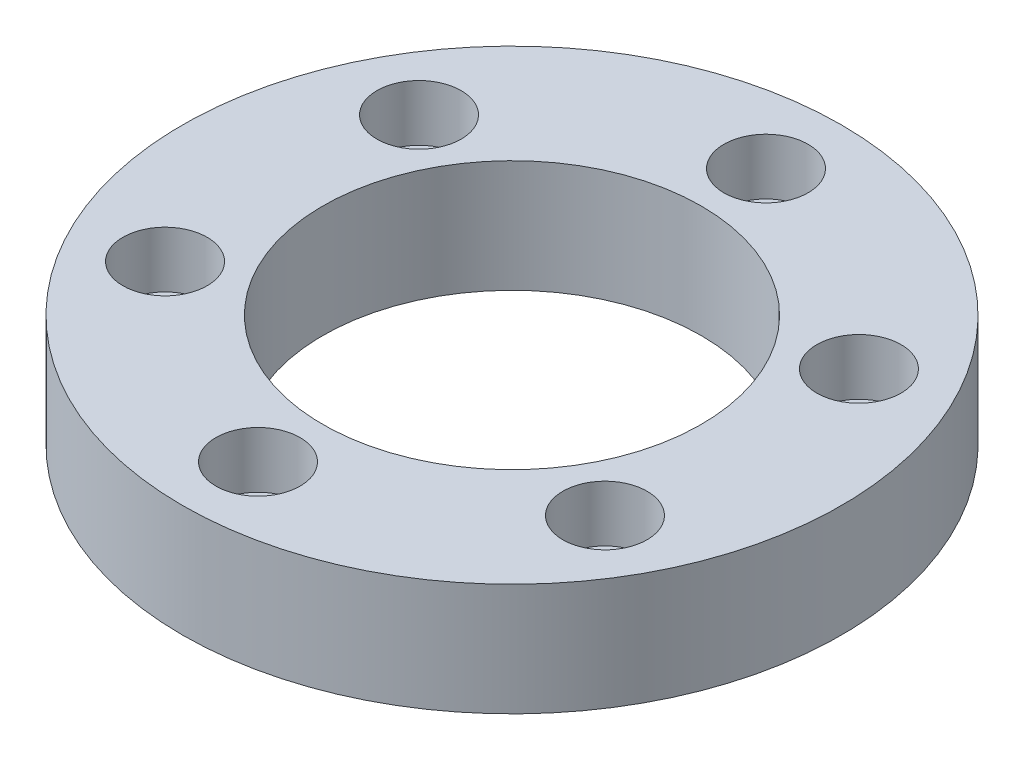
ISO-10303-21;
HEADER;
FILE_DESCRIPTION(('STEP AP214'),'2;1');
FILE_NAME('part.step','',(''),(''),'','','');
FILE_SCHEMA(('AUTOMOTIVE_DESIGN { 1 0 10303 214 1 1 1 1 }'));
ENDSEC;
DATA;
#1=APPLICATION_CONTEXT('core data for automotive mechanical design processes');
#2=APPLICATION_PROTOCOL_DEFINITION('international standard','automotive_design',2000,#1);
#3=PRODUCT_CONTEXT('',#1,'mechanical');
#4=PRODUCT('Part','Part','',(#3));
#5=PRODUCT_RELATED_PRODUCT_CATEGORY('part','',(#4));
#6=PRODUCT_DEFINITION_FORMATION('','',#4);
#7=PRODUCT_DEFINITION_CONTEXT('part definition',#1,'design');
#8=PRODUCT_DEFINITION('design','',#6,#7);
#9=PRODUCT_DEFINITION_SHAPE('','',#8);
#10=(LENGTH_UNIT() NAMED_UNIT(*) SI_UNIT(.MILLI.,.METRE.));
#11=(NAMED_UNIT(*) PLANE_ANGLE_UNIT() SI_UNIT($,.RADIAN.));
#12=(NAMED_UNIT(*) SI_UNIT($,.STERADIAN.) SOLID_ANGLE_UNIT());
#13=UNCERTAINTY_MEASURE_WITH_UNIT(LENGTH_MEASURE(1.E-05),#10,'distance_accuracy_value','');
#14=(GEOMETRIC_REPRESENTATION_CONTEXT(3) GLOBAL_UNCERTAINTY_ASSIGNED_CONTEXT((#13)) GLOBAL_UNIT_ASSIGNED_CONTEXT((#10,
#11,#12)) REPRESENTATION_CONTEXT('',''));
#15=CARTESIAN_POINT('',(0.,0.,0.));
#16=DIRECTION('',(0.,0.,1.));
#17=DIRECTION('',(1.,0.,0.));
#18=AXIS2_PLACEMENT_3D('',#15,#16,#17);
#19=CARTESIAN_POINT('',(-15.6750598084982,-2.,-9.05000000000018));
#20=DIRECTION('',(0.,1.,0.));
#21=DIRECTION('',(0.,0.,1.));
#22=AXIS2_PLACEMENT_3D('',#19,#20,#21);
#23=CYLINDRICAL_SURFACE('',#22,1.75);
#24=CARTESIAN_POINT('',(-15.6750598084982,0.,-9.05000000000018));
#25=DIRECTION('',(0.,-1.,0.));
#26=DIRECTION('',(0.,0.,-1.));
#27=AXIS2_PLACEMENT_3D('',#24,#25,#26);
#28=CIRCLE('',#27,1.75);
#29=CARTESIAN_POINT('',(-15.6750598084982,0.,-10.8000000000002));
#30=VERTEX_POINT('',#29);
#31=EDGE_CURVE('E76',#30,#30,#28,.T.);
#32=ORIENTED_EDGE('',*,*,#31,.T.);
#33=EDGE_LOOP('',(#32));
#34=FACE_BOUND('',#33,.T.);
#35=CARTESIAN_POINT('',(-15.6750598084982,4.,-9.05000000000018));
#36=DIRECTION('',(0.,1.,0.));
#37=DIRECTION('',(0.,0.,1.));
#38=AXIS2_PLACEMENT_3D('',#35,#36,#37);
#39=CIRCLE('',#38,1.75);
#40=CARTESIAN_POINT('',(-15.6750598084982,4.,-7.30000000000018));
#41=VERTEX_POINT('',#40);
#42=EDGE_CURVE('E83',#41,#41,#39,.T.);
#43=ORIENTED_EDGE('',*,*,#42,.T.);
#44=EDGE_LOOP('',(#43));
#45=FACE_BOUND('',#44,.T.);
#46=ADVANCED_FACE('F41',(#34,#45),#23,.F.);
#47=CARTESIAN_POINT('',(-15.6750598084984,-2.,9.04999999999986));
#48=DIRECTION('',(0.,1.,0.));
#49=DIRECTION('',(0.,0.,1.));
#50=AXIS2_PLACEMENT_3D('',#47,#48,#49);
#51=CYLINDRICAL_SURFACE('',#50,1.75);
#52=CARTESIAN_POINT('',(-15.6750598084984,0.,9.04999999999986));
#53=DIRECTION('',(0.,-1.,0.));
#54=DIRECTION('',(0.,0.,-1.));
#55=AXIS2_PLACEMENT_3D('',#52,#53,#54);
#56=CIRCLE('',#55,1.75);
#57=CARTESIAN_POINT('',(-15.6750598084984,0.,7.29999999999985));
#58=VERTEX_POINT('',#57);
#59=EDGE_CURVE('E73',#58,#58,#56,.T.);
#60=ORIENTED_EDGE('',*,*,#59,.T.);
#61=EDGE_LOOP('',(#60));
#62=FACE_BOUND('',#61,.T.);
#63=CARTESIAN_POINT('',(-15.6750598084984,4.,9.04999999999986));
#64=DIRECTION('',(0.,1.,0.));
#65=DIRECTION('',(0.,0.,1.));
#66=AXIS2_PLACEMENT_3D('',#63,#64,#65);
#67=CIRCLE('',#66,1.75);
#68=CARTESIAN_POINT('',(-15.6750598084984,4.,10.7999999999999));
#69=VERTEX_POINT('',#68);
#70=EDGE_CURVE('E102',#69,#69,#67,.T.);
#71=ORIENTED_EDGE('',*,*,#70,.T.);
#72=EDGE_LOOP('',(#71));
#73=FACE_BOUND('',#72,.T.);
#74=ADVANCED_FACE('F176',(#62,#73),#51,.F.);
#75=CARTESIAN_POINT('',(-1.26391624466121E-13,-2.,18.1));
#76=DIRECTION('',(0.,1.,0.));
#77=DIRECTION('',(0.,0.,1.));
#78=AXIS2_PLACEMENT_3D('',#75,#76,#77);
#79=CYLINDRICAL_SURFACE('',#78,1.75);
#80=CARTESIAN_POINT('',(-1.26391624466121E-13,0.,18.1));
#81=DIRECTION('',(0.,-1.,0.));
#82=DIRECTION('',(0.,0.,-1.));
#83=AXIS2_PLACEMENT_3D('',#80,#81,#82);
#84=CIRCLE('',#83,1.75);
#85=CARTESIAN_POINT('',(-1.26391624466121E-13,0.,16.35));
#86=VERTEX_POINT('',#85);
#87=EDGE_CURVE('E70',#86,#86,#84,.T.);
#88=ORIENTED_EDGE('',*,*,#87,.T.);
#89=EDGE_LOOP('',(#88));
#90=FACE_BOUND('',#89,.T.);
#91=CARTESIAN_POINT('',(-1.26391624466121E-13,4.,18.1));
#92=DIRECTION('',(0.,1.,0.));
#93=DIRECTION('',(0.,0.,1.));
#94=AXIS2_PLACEMENT_3D('',#91,#92,#93);
#95=CIRCLE('',#94,1.75);
#96=CARTESIAN_POINT('',(-1.26391624466121E-13,4.,19.85));
#97=VERTEX_POINT('',#96);
#98=EDGE_CURVE('E92',#97,#97,#95,.T.);
#99=ORIENTED_EDGE('',*,*,#98,.T.);
#100=EDGE_LOOP('',(#99));
#101=FACE_BOUND('',#100,.T.);
#102=ADVANCED_FACE('F182',(#90,#101),#79,.F.);
#103=CARTESIAN_POINT('',(15.6750598084983,-2.,9.05000000000008));
#104=DIRECTION('',(0.,1.,0.));
#105=DIRECTION('',(0.,0.,1.));
#106=AXIS2_PLACEMENT_3D('',#103,#104,#105);
#107=CYLINDRICAL_SURFACE('',#106,1.75);
#108=CARTESIAN_POINT('',(15.6750598084983,0.,9.05000000000008));
#109=DIRECTION('',(0.,-1.,0.));
#110=DIRECTION('',(0.,0.,-1.));
#111=AXIS2_PLACEMENT_3D('',#108,#109,#110);
#112=CIRCLE('',#111,1.75);
#113=CARTESIAN_POINT('',(15.6750598084983,0.,7.30000000000008));
#114=VERTEX_POINT('',#113);
#115=EDGE_CURVE('E67',#114,#114,#112,.T.);
#116=ORIENTED_EDGE('',*,*,#115,.T.);
#117=EDGE_LOOP('',(#116));
#118=FACE_BOUND('',#117,.T.);
#119=CARTESIAN_POINT('',(15.6750598084983,4.,9.05000000000008));
#120=DIRECTION('',(0.,1.,0.));
#121=DIRECTION('',(0.,0.,1.));
#122=AXIS2_PLACEMENT_3D('',#119,#120,#121);
#123=CIRCLE('',#122,1.75);
#124=CARTESIAN_POINT('',(15.6750598084983,4.,10.8000000000001));
#125=VERTEX_POINT('',#124);
#126=EDGE_CURVE('E128',#125,#125,#123,.T.);
#127=ORIENTED_EDGE('',*,*,#126,.T.);
#128=EDGE_LOOP('',(#127));
#129=FACE_BOUND('',#128,.T.);
#130=ADVANCED_FACE('F134',(#118,#129),#107,.F.);
#131=CARTESIAN_POINT('',(15.6750598084984,-2.,-9.04999999999997));
#132=DIRECTION('',(0.,1.,0.));
#133=DIRECTION('',(0.,0.,1.));
#134=AXIS2_PLACEMENT_3D('',#131,#132,#133);
#135=CYLINDRICAL_SURFACE('',#134,1.75);
#136=CARTESIAN_POINT('',(15.6750598084984,0.,-9.04999999999997));
#137=DIRECTION('',(0.,-1.,0.));
#138=DIRECTION('',(0.,0.,-1.));
#139=AXIS2_PLACEMENT_3D('',#136,#137,#138);
#140=CIRCLE('',#139,1.75);
#141=CARTESIAN_POINT('',(15.6750598084984,0.,-10.8));
#142=VERTEX_POINT('',#141);
#143=EDGE_CURVE('E64',#142,#142,#140,.T.);
#144=ORIENTED_EDGE('',*,*,#143,.T.);
#145=EDGE_LOOP('',(#144));
#146=FACE_BOUND('',#145,.T.);
#147=CARTESIAN_POINT('',(15.6750598084984,4.,-9.04999999999997));
#148=DIRECTION('',(0.,1.,0.));
#149=DIRECTION('',(0.,0.,1.));
#150=AXIS2_PLACEMENT_3D('',#147,#148,#149);
#151=CIRCLE('',#150,1.75);
#152=CARTESIAN_POINT('',(15.6750598084984,4.,-7.29999999999997));
#153=VERTEX_POINT('',#152);
#154=EDGE_CURVE('E111',#153,#153,#151,.T.);
#155=ORIENTED_EDGE('',*,*,#154,.T.);
#156=EDGE_LOOP('',(#155));
#157=FACE_BOUND('',#156,.T.);
#158=ADVANCED_FACE('F187',(#146,#157),#135,.F.);
#159=CARTESIAN_POINT('',(0.,-2.,-18.1));
#160=DIRECTION('',(0.,1.,0.));
#161=DIRECTION('',(0.,0.,1.));
#162=AXIS2_PLACEMENT_3D('',#159,#160,#161);
#163=CYLINDRICAL_SURFACE('',#162,1.75);
#164=CARTESIAN_POINT('',(0.,0.,-18.1));
#165=DIRECTION('',(0.,-1.,0.));
#166=DIRECTION('',(0.,0.,-1.));
#167=AXIS2_PLACEMENT_3D('',#164,#165,#166);
#168=CIRCLE('',#167,1.75);
#169=CARTESIAN_POINT('',(0.,0.,-19.85));
#170=VERTEX_POINT('',#169);
#171=EDGE_CURVE('E61',#170,#170,#168,.T.);
#172=ORIENTED_EDGE('',*,*,#171,.T.);
#173=EDGE_LOOP('',(#172));
#174=FACE_BOUND('',#173,.T.);
#175=CARTESIAN_POINT('',(0.,4.,-18.1));
#176=DIRECTION('',(0.,1.,0.));
#177=DIRECTION('',(0.,0.,1.));
#178=AXIS2_PLACEMENT_3D('',#175,#176,#177);
#179=CIRCLE('',#178,1.75);
#180=CARTESIAN_POINT('',(0.,4.,-16.35));
#181=VERTEX_POINT('',#180);
#182=EDGE_CURVE('E120',#181,#181,#179,.T.);
#183=ORIENTED_EDGE('',*,*,#182,.T.);
#184=EDGE_LOOP('',(#183));
#185=FACE_BOUND('',#184,.T.);
#186=ADVANCED_FACE('F197',(#174,#185),#163,.F.);
#187=CARTESIAN_POINT('',(0.,0.,-13.485));
#188=DIRECTION('',(0.,-1.,0.));
#189=DIRECTION('',(0.,0.,-1.));
#190=AXIS2_PLACEMENT_3D('',#187,#188,#189);
#191=PLANE('',#190);
#192=ORIENTED_EDGE('',*,*,#171,.F.);
#193=EDGE_LOOP('',(#192));
#194=FACE_BOUND('',#193,.T.);
#195=ORIENTED_EDGE('',*,*,#143,.F.);
#196=EDGE_LOOP('',(#195));
#197=FACE_BOUND('',#196,.T.);
#198=ORIENTED_EDGE('',*,*,#115,.F.);
#199=EDGE_LOOP('',(#198));
#200=FACE_BOUND('',#199,.T.);
#201=ORIENTED_EDGE('',*,*,#87,.F.);
#202=EDGE_LOOP('',(#201));
#203=FACE_BOUND('',#202,.T.);
#204=ORIENTED_EDGE('',*,*,#59,.F.);
#205=EDGE_LOOP('',(#204));
#206=FACE_BOUND('',#205,.T.);
#207=ORIENTED_EDGE('',*,*,#31,.F.);
#208=EDGE_LOOP('',(#207));
#209=FACE_BOUND('',#208,.T.);
#210=CARTESIAN_POINT('',(0.,0.,0.));
#211=DIRECTION('',(0.,-1.,0.));
#212=DIRECTION('',(0.,0.,-1.));
#213=AXIS2_PLACEMENT_3D('',#210,#211,#212);
#214=CIRCLE('',#213,23.485);
#215=CARTESIAN_POINT('',(0.,0.,-23.485));
#216=VERTEX_POINT('',#215);
#217=EDGE_CURVE('E10',#216,#216,#214,.T.);
#218=ORIENTED_EDGE('',*,*,#217,.T.);
#219=EDGE_LOOP('',(#218));
#220=FACE_BOUND('',#219,.T.);
#221=CARTESIAN_POINT('',(0.,0.,0.));
#222=DIRECTION('',(0.,-1.,0.));
#223=DIRECTION('',(0.,0.,-1.));
#224=AXIS2_PLACEMENT_3D('',#221,#222,#223);
#225=CIRCLE('',#224,13.485);
#226=CARTESIAN_POINT('',(0.,0.,-13.485));
#227=VERTEX_POINT('',#226);
#228=EDGE_CURVE('E56',#227,#227,#225,.T.);
#229=ORIENTED_EDGE('',*,*,#228,.F.);
#230=EDGE_LOOP('',(#229));
#231=FACE_BOUND('',#230,.T.);
#232=ADVANCED_FACE('F43',(#194,#197,#200,#203,#206,#209,#220,#231),#191,.T.);
#233=CARTESIAN_POINT('',(0.,0.,0.));
#234=DIRECTION('',(0.,-1.,0.));
#235=DIRECTION('',(0.,0.,-1.));
#236=AXIS2_PLACEMENT_3D('',#233,#234,#235);
#237=CYLINDRICAL_SURFACE('',#236,23.485);
#238=CARTESIAN_POINT('',(0.,8.,0.));
#239=DIRECTION('',(0.,-1.,0.));
#240=DIRECTION('',(0.,0.,-1.));
#241=AXIS2_PLACEMENT_3D('',#238,#239,#240);
#242=CIRCLE('',#241,23.485);
#243=CARTESIAN_POINT('',(0.,8.,-23.485));
#244=VERTEX_POINT('',#243);
#245=EDGE_CURVE('E48',#244,#244,#242,.T.);
#246=ORIENTED_EDGE('',*,*,#245,.T.);
#247=EDGE_LOOP('',(#246));
#248=FACE_BOUND('',#247,.T.);
#249=ORIENTED_EDGE('',*,*,#217,.F.);
#250=EDGE_LOOP('',(#249));
#251=FACE_BOUND('',#250,.T.);
#252=ADVANCED_FACE('F154',(#248,#251),#237,.T.);
#253=CARTESIAN_POINT('',(0.,8.,-23.485));
#254=DIRECTION('',(0.,1.,0.));
#255=DIRECTION('',(0.,0.,1.));
#256=AXIS2_PLACEMENT_3D('',#253,#254,#255);
#257=PLANE('',#256);
#258=CARTESIAN_POINT('',(0.,8.,-18.1));
#259=DIRECTION('',(0.,1.,0.));
#260=DIRECTION('',(0.,0.,1.));
#261=AXIS2_PLACEMENT_3D('',#258,#259,#260);
#262=CIRCLE('',#261,3.);
#263=CARTESIAN_POINT('',(0.,8.,-15.1));
#264=VERTEX_POINT('',#263);
#265=EDGE_CURVE('E115',#264,#264,#262,.T.);
#266=ORIENTED_EDGE('',*,*,#265,.F.);
#267=EDGE_LOOP('',(#266));
#268=FACE_BOUND('',#267,.T.);
#269=CARTESIAN_POINT('',(15.6750598084984,8.,-9.04999999999997));
#270=DIRECTION('',(0.,1.,0.));
#271=DIRECTION('',(0.,0.,1.));
#272=AXIS2_PLACEMENT_3D('',#269,#270,#271);
#273=CIRCLE('',#272,3.);
#274=CARTESIAN_POINT('',(15.6750598084984,8.,-6.04999999999997));
#275=VERTEX_POINT('',#274);
#276=EDGE_CURVE('E106',#275,#275,#273,.T.);
#277=ORIENTED_EDGE('',*,*,#276,.F.);
#278=EDGE_LOOP('',(#277));
#279=FACE_BOUND('',#278,.T.);
#280=CARTESIAN_POINT('',(-15.6750598084984,8.,9.04999999999986));
#281=DIRECTION('',(0.,1.,0.));
#282=DIRECTION('',(0.,0.,1.));
#283=AXIS2_PLACEMENT_3D('',#280,#281,#282);
#284=CIRCLE('',#283,3.);
#285=CARTESIAN_POINT('',(-15.6750598084984,8.,12.0499999999999));
#286=VERTEX_POINT('',#285);
#287=EDGE_CURVE('E97',#286,#286,#284,.T.);
#288=ORIENTED_EDGE('',*,*,#287,.F.);
#289=EDGE_LOOP('',(#288));
#290=FACE_BOUND('',#289,.T.);
#291=CARTESIAN_POINT('',(-1.26391624466121E-13,8.,18.1));
#292=DIRECTION('',(0.,1.,0.));
#293=DIRECTION('',(0.,0.,1.));
#294=AXIS2_PLACEMENT_3D('',#291,#292,#293);
#295=CIRCLE('',#294,3.);
#296=CARTESIAN_POINT('',(-1.26391624466121E-13,8.,21.1));
#297=VERTEX_POINT('',#296);
#298=EDGE_CURVE('E89',#297,#297,#295,.T.);
#299=ORIENTED_EDGE('',*,*,#298,.F.);
#300=EDGE_LOOP('',(#299));
#301=FACE_BOUND('',#300,.T.);
#302=CARTESIAN_POINT('',(15.6750598084983,8.,9.05000000000008));
#303=DIRECTION('',(0.,1.,0.));
#304=DIRECTION('',(0.,0.,1.));
#305=AXIS2_PLACEMENT_3D('',#302,#303,#304);
#306=CIRCLE('',#305,3.);
#307=CARTESIAN_POINT('',(15.6750598084983,8.,12.0500000000001));
#308=VERTEX_POINT('',#307);
#309=EDGE_CURVE('E125',#308,#308,#306,.T.);
#310=ORIENTED_EDGE('',*,*,#309,.F.);
#311=EDGE_LOOP('',(#310));
#312=FACE_BOUND('',#311,.T.);
#313=CARTESIAN_POINT('',(-15.6750598084982,8.,-9.05000000000018));
#314=DIRECTION('',(0.,1.,0.));
#315=DIRECTION('',(0.,0.,1.));
#316=AXIS2_PLACEMENT_3D('',#313,#314,#315);
#317=CIRCLE('',#316,3.);
#318=CARTESIAN_POINT('',(-15.6750598084982,8.,-6.05000000000018));
#319=VERTEX_POINT('',#318);
#320=EDGE_CURVE('E80',#319,#319,#317,.T.);
#321=ORIENTED_EDGE('',*,*,#320,.F.);
#322=EDGE_LOOP('',(#321));
#323=FACE_BOUND('',#322,.T.);
#324=CARTESIAN_POINT('',(0.,8.,0.));
#325=DIRECTION('',(0.,-1.,0.));
#326=DIRECTION('',(0.,0.,-1.));
#327=AXIS2_PLACEMENT_3D('',#324,#325,#326);
#328=CIRCLE('',#327,13.485);
#329=CARTESIAN_POINT('',(0.,8.,-13.485));
#330=VERTEX_POINT('',#329);
#331=EDGE_CURVE('E52',#330,#330,#328,.T.);
#332=ORIENTED_EDGE('',*,*,#331,.T.);
#333=EDGE_LOOP('',(#332));
#334=FACE_BOUND('',#333,.T.);
#335=ORIENTED_EDGE('',*,*,#245,.F.);
#336=EDGE_LOOP('',(#335));
#337=FACE_BOUND('',#336,.T.);
#338=ADVANCED_FACE('F150',(#268,#279,#290,#301,#312,#323,#334,#337),#257,.T.);
#339=CARTESIAN_POINT('',(0.,0.,0.));
#340=DIRECTION('',(0.,-1.,0.));
#341=DIRECTION('',(0.,0.,-1.));
#342=AXIS2_PLACEMENT_3D('',#339,#340,#341);
#343=CYLINDRICAL_SURFACE('',#342,13.485);
#344=ORIENTED_EDGE('',*,*,#228,.T.);
#345=EDGE_LOOP('',(#344));
#346=FACE_BOUND('',#345,.T.);
#347=ORIENTED_EDGE('',*,*,#331,.F.);
#348=EDGE_LOOP('',(#347));
#349=FACE_BOUND('',#348,.T.);
#350=ADVANCED_FACE('F153',(#346,#349),#343,.F.);
#351=CARTESIAN_POINT('',(0.,4.,-18.1));
#352=DIRECTION('',(0.,1.,0.));
#353=DIRECTION('',(0.,0.,1.));
#354=AXIS2_PLACEMENT_3D('',#351,#352,#353);
#355=CYLINDRICAL_SURFACE('',#354,3.);
#356=CARTESIAN_POINT('',(0.,4.,-18.1));
#357=DIRECTION('',(0.,1.,0.));
#358=DIRECTION('',(0.,0.,1.));
#359=AXIS2_PLACEMENT_3D('',#356,#357,#358);
#360=CIRCLE('',#359,3.);
#361=CARTESIAN_POINT('',(0.,4.,-15.1));
#362=VERTEX_POINT('',#361);
#363=EDGE_CURVE('E84',#362,#362,#360,.T.);
#364=ORIENTED_EDGE('',*,*,#363,.F.);
#365=EDGE_LOOP('',(#364));
#366=FACE_BOUND('',#365,.T.);
#367=ORIENTED_EDGE('',*,*,#265,.T.);
#368=EDGE_LOOP('',(#367));
#369=FACE_BOUND('',#368,.T.);
#370=ADVANCED_FACE('F163',(#366,#369),#355,.F.);
#371=CARTESIAN_POINT('',(0.,4.,0.));
#372=DIRECTION('',(0.,1.,0.));
#373=DIRECTION('',(0.,0.,1.));
#374=AXIS2_PLACEMENT_3D('',#371,#372,#373);
#375=PLANE('',#374);
#376=ORIENTED_EDGE('',*,*,#182,.F.);
#377=EDGE_LOOP('',(#376));
#378=FACE_BOUND('',#377,.T.);
#379=ORIENTED_EDGE('',*,*,#363,.T.);
#380=EDGE_LOOP('',(#379));
#381=FACE_BOUND('',#380,.T.);
#382=ADVANCED_FACE('F171',(#378,#381),#375,.T.);
#383=CARTESIAN_POINT('',(15.6750598084984,4.,-9.04999999999997));
#384=DIRECTION('',(0.,1.,0.));
#385=DIRECTION('',(0.,0.,1.));
#386=AXIS2_PLACEMENT_3D('',#383,#384,#385);
#387=CYLINDRICAL_SURFACE('',#386,3.);
#388=CARTESIAN_POINT('',(15.6750598084984,4.,-9.04999999999997));
#389=DIRECTION('',(0.,1.,0.));
#390=DIRECTION('',(0.,0.,1.));
#391=AXIS2_PLACEMENT_3D('',#388,#389,#390);
#392=CIRCLE('',#391,3.);
#393=CARTESIAN_POINT('',(15.6750598084984,4.,-6.04999999999997));
#394=VERTEX_POINT('',#393);
#395=EDGE_CURVE('E112',#394,#394,#392,.T.);
#396=ORIENTED_EDGE('',*,*,#395,.F.);
#397=EDGE_LOOP('',(#396));
#398=FACE_BOUND('',#397,.T.);
#399=ORIENTED_EDGE('',*,*,#276,.T.);
#400=EDGE_LOOP('',(#399));
#401=FACE_BOUND('',#400,.T.);
#402=ADVANCED_FACE('F256',(#398,#401),#387,.F.);
#403=CARTESIAN_POINT('',(0.,4.,0.));
#404=DIRECTION('',(0.,1.,0.));
#405=DIRECTION('',(0.,0.,1.));
#406=AXIS2_PLACEMENT_3D('',#403,#404,#405);
#407=PLANE('',#406);
#408=ORIENTED_EDGE('',*,*,#154,.F.);
#409=EDGE_LOOP('',(#408));
#410=FACE_BOUND('',#409,.T.);
#411=ORIENTED_EDGE('',*,*,#395,.T.);
#412=EDGE_LOOP('',(#411));
#413=FACE_BOUND('',#412,.T.);
#414=ADVANCED_FACE('F146',(#410,#413),#407,.T.);
#415=CARTESIAN_POINT('',(15.6750598084983,4.,9.05000000000008));
#416=DIRECTION('',(0.,1.,0.));
#417=DIRECTION('',(0.,0.,1.));
#418=AXIS2_PLACEMENT_3D('',#415,#416,#417);
#419=CYLINDRICAL_SURFACE('',#418,3.);
#420=CARTESIAN_POINT('',(15.6750598084983,4.,9.05000000000008));
#421=DIRECTION('',(0.,1.,0.));
#422=DIRECTION('',(0.,0.,1.));
#423=AXIS2_PLACEMENT_3D('',#420,#421,#422);
#424=CIRCLE('',#423,3.);
#425=CARTESIAN_POINT('',(15.6750598084983,4.,12.0500000000001));
#426=VERTEX_POINT('',#425);
#427=EDGE_CURVE('E93',#426,#426,#424,.T.);
#428=ORIENTED_EDGE('',*,*,#427,.F.);
#429=EDGE_LOOP('',(#428));
#430=FACE_BOUND('',#429,.T.);
#431=ORIENTED_EDGE('',*,*,#309,.T.);
#432=EDGE_LOOP('',(#431));
#433=FACE_BOUND('',#432,.T.);
#434=ADVANCED_FACE('F140',(#430,#433),#419,.F.);
#435=CARTESIAN_POINT('',(0.,4.,0.));
#436=DIRECTION('',(0.,1.,0.));
#437=DIRECTION('',(0.,0.,1.));
#438=AXIS2_PLACEMENT_3D('',#435,#436,#437);
#439=PLANE('',#438);
#440=ORIENTED_EDGE('',*,*,#126,.F.);
#441=EDGE_LOOP('',(#440));
#442=FACE_BOUND('',#441,.T.);
#443=ORIENTED_EDGE('',*,*,#427,.T.);
#444=EDGE_LOOP('',(#443));
#445=FACE_BOUND('',#444,.T.);
#446=ADVANCED_FACE('F136',(#442,#445),#439,.T.);
#447=CARTESIAN_POINT('',(-1.26391624466121E-13,4.,18.1));
#448=DIRECTION('',(0.,1.,0.));
#449=DIRECTION('',(0.,0.,1.));
#450=AXIS2_PLACEMENT_3D('',#447,#448,#449);
#451=CYLINDRICAL_SURFACE('',#450,3.);
#452=CARTESIAN_POINT('',(-1.26391624466121E-13,4.,18.1));
#453=DIRECTION('',(0.,1.,0.));
#454=DIRECTION('',(0.,0.,1.));
#455=AXIS2_PLACEMENT_3D('',#452,#453,#454);
#456=CIRCLE('',#455,3.);
#457=CARTESIAN_POINT('',(-1.26391624466121E-13,4.,21.1));
#458=VERTEX_POINT('',#457);
#459=EDGE_CURVE('E94',#458,#458,#456,.T.);
#460=ORIENTED_EDGE('',*,*,#459,.F.);
#461=EDGE_LOOP('',(#460));
#462=FACE_BOUND('',#461,.T.);
#463=ORIENTED_EDGE('',*,*,#298,.T.);
#464=EDGE_LOOP('',(#463));
#465=FACE_BOUND('',#464,.T.);
#466=ADVANCED_FACE('F139',(#462,#465),#451,.F.);
#467=CARTESIAN_POINT('',(0.,4.,0.));
#468=DIRECTION('',(0.,1.,0.));
#469=DIRECTION('',(0.,0.,1.));
#470=AXIS2_PLACEMENT_3D('',#467,#468,#469);
#471=PLANE('',#470);
#472=ORIENTED_EDGE('',*,*,#98,.F.);
#473=EDGE_LOOP('',(#472));
#474=FACE_BOUND('',#473,.T.);
#475=ORIENTED_EDGE('',*,*,#459,.T.);
#476=EDGE_LOOP('',(#475));
#477=FACE_BOUND('',#476,.T.);
#478=ADVANCED_FACE('F223',(#474,#477),#471,.T.);
#479=CARTESIAN_POINT('',(-15.6750598084984,4.,9.04999999999986));
#480=DIRECTION('',(0.,1.,0.));
#481=DIRECTION('',(0.,0.,1.));
#482=AXIS2_PLACEMENT_3D('',#479,#480,#481);
#483=CYLINDRICAL_SURFACE('',#482,3.);
#484=CARTESIAN_POINT('',(-15.6750598084984,4.,9.04999999999986));
#485=DIRECTION('',(0.,1.,0.));
#486=DIRECTION('',(0.,0.,1.));
#487=AXIS2_PLACEMENT_3D('',#484,#485,#486);
#488=CIRCLE('',#487,3.);
#489=CARTESIAN_POINT('',(-15.6750598084984,4.,12.0499999999999));
#490=VERTEX_POINT('',#489);
#491=EDGE_CURVE('E103',#490,#490,#488,.T.);
#492=ORIENTED_EDGE('',*,*,#491,.F.);
#493=EDGE_LOOP('',(#492));
#494=FACE_BOUND('',#493,.T.);
#495=ORIENTED_EDGE('',*,*,#287,.T.);
#496=EDGE_LOOP('',(#495));
#497=FACE_BOUND('',#496,.T.);
#498=ADVANCED_FACE('F217',(#494,#497),#483,.F.);
#499=CARTESIAN_POINT('',(0.,4.,0.));
#500=DIRECTION('',(0.,1.,0.));
#501=DIRECTION('',(0.,0.,1.));
#502=AXIS2_PLACEMENT_3D('',#499,#500,#501);
#503=PLANE('',#502);
#504=ORIENTED_EDGE('',*,*,#70,.F.);
#505=EDGE_LOOP('',(#504));
#506=FACE_BOUND('',#505,.T.);
#507=ORIENTED_EDGE('',*,*,#491,.T.);
#508=EDGE_LOOP('',(#507));
#509=FACE_BOUND('',#508,.T.);
#510=ADVANCED_FACE('F213',(#506,#509),#503,.T.);
#511=CARTESIAN_POINT('',(-15.6750598084982,4.,-9.05000000000018));
#512=DIRECTION('',(0.,1.,0.));
#513=DIRECTION('',(0.,0.,1.));
#514=AXIS2_PLACEMENT_3D('',#511,#512,#513);
#515=CYLINDRICAL_SURFACE('',#514,3.);
#516=CARTESIAN_POINT('',(-15.6750598084982,4.,-9.05000000000018));
#517=DIRECTION('',(0.,1.,0.));
#518=DIRECTION('',(0.,0.,1.));
#519=AXIS2_PLACEMENT_3D('',#516,#517,#518);
#520=CIRCLE('',#519,3.);
#521=CARTESIAN_POINT('',(-15.6750598084982,4.,-6.05000000000018));
#522=VERTEX_POINT('',#521);
#523=EDGE_CURVE('E79',#522,#522,#520,.T.);
#524=ORIENTED_EDGE('',*,*,#523,.F.);
#525=EDGE_LOOP('',(#524));
#526=FACE_BOUND('',#525,.T.);
#527=ORIENTED_EDGE('',*,*,#320,.T.);
#528=EDGE_LOOP('',(#527));
#529=FACE_BOUND('',#528,.T.);
#530=ADVANCED_FACE('F216',(#526,#529),#515,.F.);
#531=CARTESIAN_POINT('',(0.,4.,0.));
#532=DIRECTION('',(0.,1.,0.));
#533=DIRECTION('',(0.,0.,1.));
#534=AXIS2_PLACEMENT_3D('',#531,#532,#533);
#535=PLANE('',#534);
#536=ORIENTED_EDGE('',*,*,#42,.F.);
#537=EDGE_LOOP('',(#536));
#538=FACE_BOUND('',#537,.T.);
#539=ORIENTED_EDGE('',*,*,#523,.T.);
#540=EDGE_LOOP('',(#539));
#541=FACE_BOUND('',#540,.T.);
#542=ADVANCED_FACE('F240',(#538,#541),#535,.T.);
#543=CLOSED_SHELL('',(#46,#74,#102,#130,#158,#186,#232,#252,#338,#350,#370,#382,#402,#414,#434,
#446,#466,#478,#498,#510,#530,#542));
#544=MANIFOLD_SOLID_BREP('B2',#543);
#545=ADVANCED_BREP_SHAPE_REPRESENTATION('',(#18,#544),#14);
#546=SHAPE_DEFINITION_REPRESENTATION(#9,#545);
ENDSEC;
END-ISO-10303-21;
